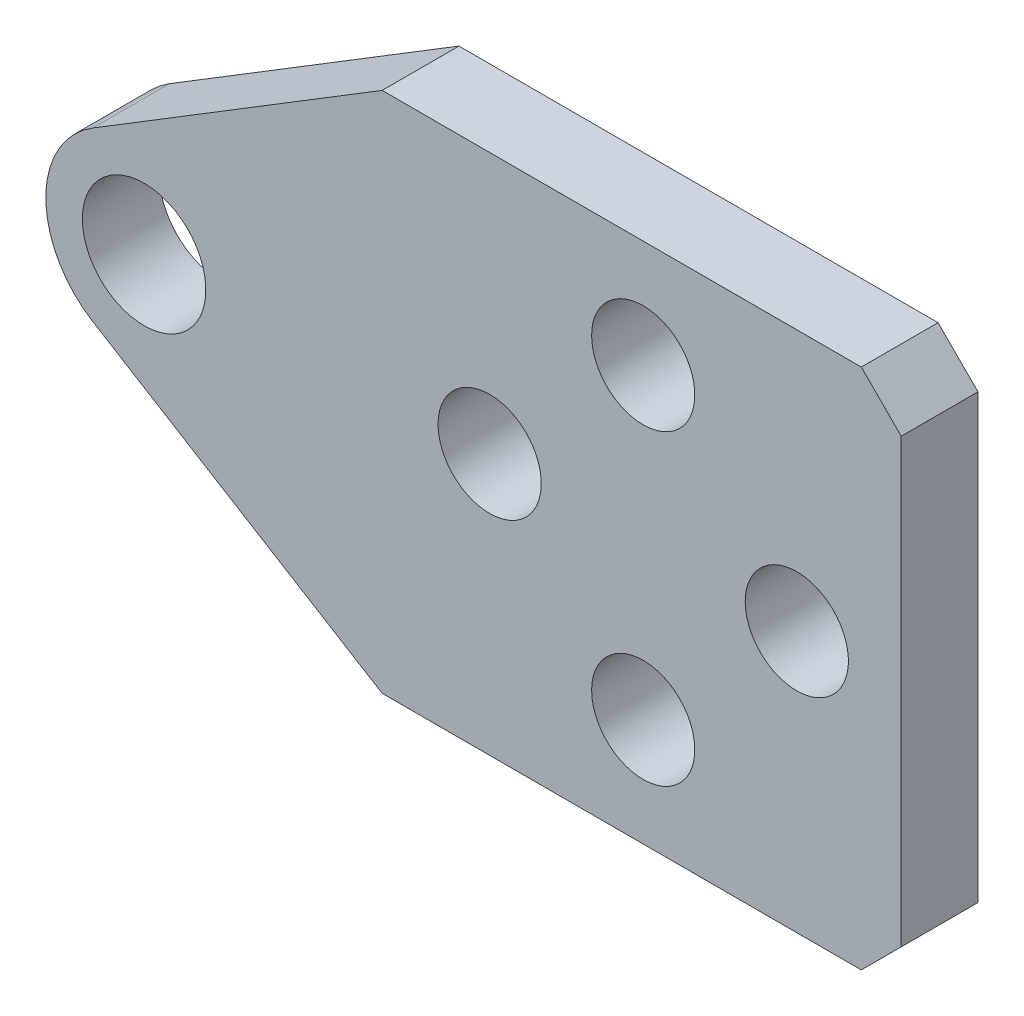
ISO-10303-21;
HEADER;
FILE_DESCRIPTION(('STEP AP214'),'2;1');
FILE_NAME('part.step','',(''),(''),'','','');
FILE_SCHEMA(('AUTOMOTIVE_DESIGN { 1 0 10303 214 1 1 1 1 }'));
ENDSEC;
DATA;
#1=APPLICATION_CONTEXT('core data for automotive mechanical design processes');
#2=APPLICATION_PROTOCOL_DEFINITION('international standard','automotive_design',2000,#1);
#3=PRODUCT_CONTEXT('',#1,'mechanical');
#4=PRODUCT('Part','Part','',(#3));
#5=PRODUCT_RELATED_PRODUCT_CATEGORY('part','',(#4));
#6=PRODUCT_DEFINITION_FORMATION('','',#4);
#7=PRODUCT_DEFINITION_CONTEXT('part definition',#1,'design');
#8=PRODUCT_DEFINITION('design','',#6,#7);
#9=PRODUCT_DEFINITION_SHAPE('','',#8);
#10=(LENGTH_UNIT() NAMED_UNIT(*) SI_UNIT(.MILLI.,.METRE.));
#11=(NAMED_UNIT(*) PLANE_ANGLE_UNIT() SI_UNIT($,.RADIAN.));
#12=(NAMED_UNIT(*) SI_UNIT($,.STERADIAN.) SOLID_ANGLE_UNIT());
#13=UNCERTAINTY_MEASURE_WITH_UNIT(LENGTH_MEASURE(1.E-05),#10,'distance_accuracy_value','');
#14=(GEOMETRIC_REPRESENTATION_CONTEXT(3) GLOBAL_UNCERTAINTY_ASSIGNED_CONTEXT((#13)) GLOBAL_UNIT_ASSIGNED_CONTEXT((#10,
#11,#12)) REPRESENTATION_CONTEXT('',''));
#15=CARTESIAN_POINT('',(0.,0.,0.));
#16=DIRECTION('',(0.,0.,1.));
#17=DIRECTION('',(1.,0.,0.));
#18=AXIS2_PLACEMENT_3D('',#15,#16,#17);
#19=CARTESIAN_POINT('',(-20.6375,0.,0.));
#20=DIRECTION('',(0.,0.,1.));
#21=DIRECTION('',(1.,0.,0.));
#22=AXIS2_PLACEMENT_3D('',#19,#20,#21);
#23=PLANE('',#22);
#24=CARTESIAN_POINT('',(-20.6375,0.,0.));
#25=DIRECTION('',(0.,0.,-1.));
#26=DIRECTION('',(-1.,0.,0.));
#27=AXIS2_PLACEMENT_3D('',#24,#25,#26);
#28=CIRCLE('',#27,2.5527);
#29=CARTESIAN_POINT('',(-23.1902,0.,0.));
#30=VERTEX_POINT('',#29);
#31=EDGE_CURVE('E160',#30,#30,#28,.F.);
#32=ORIENTED_EDGE('',*,*,#31,.T.);
#33=EDGE_LOOP('',(#32));
#34=FACE_BOUND('',#33,.T.);
#35=CARTESIAN_POINT('',(-6.35,0.,0.));
#36=DIRECTION('',(0.,0.,-1.));
#37=DIRECTION('',(-1.,0.,0.));
#38=AXIS2_PLACEMENT_3D('',#35,#36,#37);
#39=CIRCLE('',#38,2.1336);
#40=CARTESIAN_POINT('',(-8.4836,0.,0.));
#41=VERTEX_POINT('',#40);
#42=EDGE_CURVE('E20',#41,#41,#39,.F.);
#43=ORIENTED_EDGE('',*,*,#42,.T.);
#44=EDGE_LOOP('',(#43));
#45=FACE_BOUND('',#44,.T.);
#46=CARTESIAN_POINT('',(0.,-6.35,0.));
#47=DIRECTION('',(0.,0.,-1.));
#48=DIRECTION('',(-1.,0.,0.));
#49=AXIS2_PLACEMENT_3D('',#46,#47,#48);
#50=CIRCLE('',#49,2.1336);
#51=CARTESIAN_POINT('',(-2.1336,-6.35,0.));
#52=VERTEX_POINT('',#51);
#53=EDGE_CURVE('E163',#52,#52,#50,.F.);
#54=ORIENTED_EDGE('',*,*,#53,.T.);
#55=EDGE_LOOP('',(#54));
#56=FACE_BOUND('',#55,.T.);
#57=CARTESIAN_POINT('',(0.,6.35,0.));
#58=DIRECTION('',(0.,0.,-1.));
#59=DIRECTION('',(-1.,0.,0.));
#60=AXIS2_PLACEMENT_3D('',#57,#58,#59);
#61=CIRCLE('',#60,2.1336);
#62=CARTESIAN_POINT('',(-2.1336,6.35,0.));
#63=VERTEX_POINT('',#62);
#64=EDGE_CURVE('E104',#63,#63,#61,.F.);
#65=ORIENTED_EDGE('',*,*,#64,.T.);
#66=EDGE_LOOP('',(#65));
#67=FACE_BOUND('',#66,.T.);
#68=CARTESIAN_POINT('',(6.35,0.,0.));
#69=DIRECTION('',(0.,0.,-1.));
#70=DIRECTION('',(-1.,0.,0.));
#71=AXIS2_PLACEMENT_3D('',#68,#69,#70);
#72=CIRCLE('',#71,2.1336);
#73=CARTESIAN_POINT('',(4.2164,0.,0.));
#74=VERTEX_POINT('',#73);
#75=EDGE_CURVE('E121',#74,#74,#72,.F.);
#76=ORIENTED_EDGE('',*,*,#75,.T.);
#77=EDGE_LOOP('',(#76));
#78=FACE_BOUND('',#77,.T.);
#79=DIRECTION('',(-0.707106781186548,-0.707106781186547,0.));
#80=VECTOR('',#79,1.);
#81=CARTESIAN_POINT('',(10.668,-9.144,0.));
#82=LINE('',#81,#80);
#83=CARTESIAN_POINT('',(10.668,-9.144,0.));
#84=VERTEX_POINT('',#83);
#85=CARTESIAN_POINT('',(9.017,-10.795,0.));
#86=VERTEX_POINT('',#85);
#87=EDGE_CURVE('E88',#84,#86,#82,.T.);
#88=ORIENTED_EDGE('',*,*,#87,.T.);
#89=DIRECTION('',(1.,0.,0.));
#90=VECTOR('',#89,1.);
#91=CARTESIAN_POINT('',(10.668,-10.795,0.));
#92=LINE('',#91,#90);
#93=CARTESIAN_POINT('',(-10.795,-10.795,0.));
#94=VERTEX_POINT('',#93);
#95=EDGE_CURVE('E90',#86,#94,#92,.F.);
#96=ORIENTED_EDGE('',*,*,#95,.T.);
#97=DIRECTION('',(-0.852731064651707,0.522350199940582,0.));
#98=VECTOR('',#97,1.);
#99=CARTESIAN_POINT('',(-10.795,-10.795,0.));
#100=LINE('',#99,#98);
#101=CARTESIAN_POINT('',(-22.7603312125585,-3.46549904674454,0.));
#102=VERTEX_POINT('',#101);
#103=EDGE_CURVE('E119',#94,#102,#100,.T.);
#104=ORIENTED_EDGE('',*,*,#103,.T.);
#105=CARTESIAN_POINT('',(-20.6375,0.,0.));
#106=DIRECTION('',(0.,0.,-1.));
#107=DIRECTION('',(-1.,0.,0.));
#108=AXIS2_PLACEMENT_3D('',#105,#106,#107);
#109=CIRCLE('',#108,4.064);
#110=CARTESIAN_POINT('',(-22.7603312125585,3.46549904674454,0.));
#111=VERTEX_POINT('',#110);
#112=EDGE_CURVE('E49',#111,#102,#109,.F.);
#113=ORIENTED_EDGE('',*,*,#112,.F.);
#114=DIRECTION('',(0.852731064651707,0.522350199940582,0.));
#115=VECTOR('',#114,1.);
#116=CARTESIAN_POINT('',(-22.7603312125585,3.46549904674454,0.));
#117=LINE('',#116,#115);
#118=CARTESIAN_POINT('',(-10.795,10.795,0.));
#119=VERTEX_POINT('',#118);
#120=EDGE_CURVE('E126',#111,#119,#117,.T.);
#121=ORIENTED_EDGE('',*,*,#120,.T.);
#122=DIRECTION('',(1.,0.,0.));
#123=VECTOR('',#122,1.);
#124=CARTESIAN_POINT('',(-10.795,10.795,0.));
#125=LINE('',#124,#123);
#126=CARTESIAN_POINT('',(9.017,10.795,0.));
#127=VERTEX_POINT('',#126);
#128=EDGE_CURVE('E64',#119,#127,#125,.T.);
#129=ORIENTED_EDGE('',*,*,#128,.T.);
#130=DIRECTION('',(0.707106781186547,-0.707106781186548,0.));
#131=VECTOR('',#130,1.);
#132=CARTESIAN_POINT('',(9.017,10.795,0.));
#133=LINE('',#132,#131);
#134=CARTESIAN_POINT('',(10.668,9.144,0.));
#135=VERTEX_POINT('',#134);
#136=EDGE_CURVE('E137',#127,#135,#133,.T.);
#137=ORIENTED_EDGE('',*,*,#136,.T.);
#138=DIRECTION('',(0.,1.,0.));
#139=VECTOR('',#138,1.);
#140=CARTESIAN_POINT('',(10.668,10.795,0.));
#141=LINE('',#140,#139);
#142=EDGE_CURVE('E86',#135,#84,#141,.F.);
#143=ORIENTED_EDGE('',*,*,#142,.T.);
#144=EDGE_LOOP('',(#88,#96,#104,#113,#121,#129,#137,#143));
#145=FACE_BOUND('',#144,.T.);
#146=ADVANCED_FACE('F17',(#34,#45,#56,#67,#78,#145),#23,.F.);
#147=CARTESIAN_POINT('',(-6.35,0.,3.175));
#148=DIRECTION('',(0.,0.,-1.));
#149=DIRECTION('',(-1.,0.,0.));
#150=AXIS2_PLACEMENT_3D('',#147,#148,#149);
#151=CYLINDRICAL_SURFACE('',#150,2.1336);
#152=CARTESIAN_POINT('',(-6.35,0.,3.175));
#153=DIRECTION('',(0.,0.,-1.));
#154=DIRECTION('',(-1.,0.,0.));
#155=AXIS2_PLACEMENT_3D('',#152,#153,#154);
#156=CIRCLE('',#155,2.1336);
#157=CARTESIAN_POINT('',(-8.4836,0.,3.175));
#158=VERTEX_POINT('',#157);
#159=EDGE_CURVE('E157',#158,#158,#156,.T.);
#160=ORIENTED_EDGE('',*,*,#159,.F.);
#161=EDGE_LOOP('',(#160));
#162=FACE_BOUND('',#161,.T.);
#163=ORIENTED_EDGE('',*,*,#42,.F.);
#164=EDGE_LOOP('',(#163));
#165=FACE_BOUND('',#164,.T.);
#166=ADVANCED_FACE('F177',(#162,#165),#151,.F.);
#167=CARTESIAN_POINT('',(0.,6.35,3.175));
#168=DIRECTION('',(0.,0.,-1.));
#169=DIRECTION('',(-1.,0.,0.));
#170=AXIS2_PLACEMENT_3D('',#167,#168,#169);
#171=CYLINDRICAL_SURFACE('',#170,2.1336);
#172=CARTESIAN_POINT('',(0.,6.35,3.175));
#173=DIRECTION('',(0.,0.,-1.));
#174=DIRECTION('',(-1.,0.,0.));
#175=AXIS2_PLACEMENT_3D('',#172,#173,#174);
#176=CIRCLE('',#175,2.1336);
#177=CARTESIAN_POINT('',(-2.1336,6.35,3.175));
#178=VERTEX_POINT('',#177);
#179=EDGE_CURVE('E153',#178,#178,#176,.T.);
#180=ORIENTED_EDGE('',*,*,#179,.F.);
#181=EDGE_LOOP('',(#180));
#182=FACE_BOUND('',#181,.T.);
#183=ORIENTED_EDGE('',*,*,#64,.F.);
#184=EDGE_LOOP('',(#183));
#185=FACE_BOUND('',#184,.T.);
#186=ADVANCED_FACE('F179',(#182,#185),#171,.F.);
#187=CARTESIAN_POINT('',(10.668,-10.795,3.175));
#188=DIRECTION('',(0.,1.,0.));
#189=DIRECTION('',(0.,0.,1.));
#190=AXIS2_PLACEMENT_3D('',#187,#188,#189);
#191=PLANE('',#190);
#192=DIRECTION('',(0.,0.,1.));
#193=VECTOR('',#192,1.);
#194=CARTESIAN_POINT('',(9.017,-10.795,3.175));
#195=LINE('',#194,#193);
#196=CARTESIAN_POINT('',(9.017,-10.795,3.175));
#197=VERTEX_POINT('',#196);
#198=EDGE_CURVE('E95',#86,#197,#195,.T.);
#199=ORIENTED_EDGE('',*,*,#198,.T.);
#200=DIRECTION('',(1.,0.,0.));
#201=VECTOR('',#200,1.);
#202=CARTESIAN_POINT('',(-20.6375,-10.795,3.175));
#203=LINE('',#202,#201);
#204=CARTESIAN_POINT('',(-10.795,-10.795,3.175));
#205=VERTEX_POINT('',#204);
#206=EDGE_CURVE('E156',#205,#197,#203,.T.);
#207=ORIENTED_EDGE('',*,*,#206,.F.);
#208=DIRECTION('',(0.,0.,1.));
#209=VECTOR('',#208,1.);
#210=CARTESIAN_POINT('',(-10.795,-10.795,3.175));
#211=LINE('',#210,#209);
#212=EDGE_CURVE('E102',#205,#94,#211,.F.);
#213=ORIENTED_EDGE('',*,*,#212,.T.);
#214=ORIENTED_EDGE('',*,*,#95,.F.);
#215=EDGE_LOOP('',(#199,#207,#213,#214));
#216=FACE_BOUND('',#215,.T.);
#217=ADVANCED_FACE('F98',(#216),#191,.F.);
#218=CARTESIAN_POINT('',(10.668,-9.144,3.175));
#219=DIRECTION('',(-0.707106781186547,0.707106781186548,0.));
#220=DIRECTION('',(-0.707106781186548,-0.707106781186547,0.));
#221=AXIS2_PLACEMENT_3D('',#218,#219,#220);
#222=PLANE('',#221);
#223=ORIENTED_EDGE('',*,*,#198,.F.);
#224=ORIENTED_EDGE('',*,*,#87,.F.);
#225=DIRECTION('',(0.,0.,1.));
#226=VECTOR('',#225,1.);
#227=CARTESIAN_POINT('',(10.668,-9.144,3.175));
#228=LINE('',#227,#226);
#229=CARTESIAN_POINT('',(10.668,-9.144,3.175));
#230=VERTEX_POINT('',#229);
#231=EDGE_CURVE('E111',#84,#230,#228,.T.);
#232=ORIENTED_EDGE('',*,*,#231,.T.);
#233=DIRECTION('',(0.707106781186548,0.707106781186547,0.));
#234=VECTOR('',#233,1.);
#235=CARTESIAN_POINT('',(9.017,-10.795,3.175));
#236=LINE('',#235,#234);
#237=EDGE_CURVE('E108',#197,#230,#236,.T.);
#238=ORIENTED_EDGE('',*,*,#237,.F.);
#239=EDGE_LOOP('',(#223,#224,#232,#238));
#240=FACE_BOUND('',#239,.T.);
#241=ADVANCED_FACE('F106',(#240),#222,.F.);
#242=CARTESIAN_POINT('',(10.668,10.795,3.175));
#243=DIRECTION('',(-1.,0.,0.));
#244=DIRECTION('',(0.,0.,1.));
#245=AXIS2_PLACEMENT_3D('',#242,#243,#244);
#246=PLANE('',#245);
#247=ORIENTED_EDGE('',*,*,#231,.F.);
#248=ORIENTED_EDGE('',*,*,#142,.F.);
#249=DIRECTION('',(0.,0.,1.));
#250=VECTOR('',#249,1.);
#251=CARTESIAN_POINT('',(10.668,9.144,3.175));
#252=LINE('',#251,#250);
#253=CARTESIAN_POINT('',(10.668,9.144,3.175));
#254=VERTEX_POINT('',#253);
#255=EDGE_CURVE('E134',#135,#254,#252,.T.);
#256=ORIENTED_EDGE('',*,*,#255,.T.);
#257=DIRECTION('',(0.,1.,0.));
#258=VECTOR('',#257,1.);
#259=CARTESIAN_POINT('',(10.668,0.,3.175));
#260=LINE('',#259,#258);
#261=EDGE_CURVE('E331',#230,#254,#260,.T.);
#262=ORIENTED_EDGE('',*,*,#261,.F.);
#263=EDGE_LOOP('',(#247,#248,#256,#262));
#264=FACE_BOUND('',#263,.T.);
#265=ADVANCED_FACE('F227',(#264),#246,.F.);
#266=CARTESIAN_POINT('',(9.017,10.795,3.175));
#267=DIRECTION('',(-0.707106781186548,-0.707106781186547,0.));
#268=DIRECTION('',(0.707106781186547,-0.707106781186548,0.));
#269=AXIS2_PLACEMENT_3D('',#266,#267,#268);
#270=PLANE('',#269);
#271=ORIENTED_EDGE('',*,*,#255,.F.);
#272=ORIENTED_EDGE('',*,*,#136,.F.);
#273=DIRECTION('',(0.,0.,-1.));
#274=VECTOR('',#273,1.);
#275=CARTESIAN_POINT('',(9.017,10.795,3.175));
#276=LINE('',#275,#274);
#277=CARTESIAN_POINT('',(9.017,10.795,3.175));
#278=VERTEX_POINT('',#277);
#279=EDGE_CURVE('E133',#127,#278,#276,.F.);
#280=ORIENTED_EDGE('',*,*,#279,.T.);
#281=DIRECTION('',(-0.707106781186547,0.707106781186548,0.));
#282=VECTOR('',#281,1.);
#283=CARTESIAN_POINT('',(10.668,9.144,3.175));
#284=LINE('',#283,#282);
#285=EDGE_CURVE('E338',#254,#278,#284,.T.);
#286=ORIENTED_EDGE('',*,*,#285,.F.);
#287=EDGE_LOOP('',(#271,#272,#280,#286));
#288=FACE_BOUND('',#287,.T.);
#289=ADVANCED_FACE('F224',(#288),#270,.F.);
#290=CARTESIAN_POINT('',(-10.795,10.795,3.175));
#291=DIRECTION('',(0.,-1.,0.));
#292=DIRECTION('',(0.,0.,-1.));
#293=AXIS2_PLACEMENT_3D('',#290,#291,#292);
#294=PLANE('',#293);
#295=ORIENTED_EDGE('',*,*,#279,.F.);
#296=ORIENTED_EDGE('',*,*,#128,.F.);
#297=DIRECTION('',(0.,0.,1.));
#298=VECTOR('',#297,1.);
#299=CARTESIAN_POINT('',(-10.795,10.795,3.175));
#300=LINE('',#299,#298);
#301=CARTESIAN_POINT('',(-10.795,10.795,3.175));
#302=VERTEX_POINT('',#301);
#303=EDGE_CURVE('E129',#119,#302,#300,.T.);
#304=ORIENTED_EDGE('',*,*,#303,.T.);
#305=DIRECTION('',(1.,0.,0.));
#306=VECTOR('',#305,1.);
#307=CARTESIAN_POINT('',(-20.6375,10.795,3.175));
#308=LINE('',#307,#306);
#309=EDGE_CURVE('E350',#278,#302,#308,.F.);
#310=ORIENTED_EDGE('',*,*,#309,.F.);
#311=EDGE_LOOP('',(#295,#296,#304,#310));
#312=FACE_BOUND('',#311,.T.);
#313=ADVANCED_FACE('F220',(#312),#294,.F.);
#314=CARTESIAN_POINT('',(-22.7603312125585,3.46549904674454,3.175));
#315=DIRECTION('',(0.522350199940582,-0.852731064651707,0.));
#316=DIRECTION('',(0.852731064651707,0.522350199940582,0.));
#317=AXIS2_PLACEMENT_3D('',#314,#315,#316);
#318=PLANE('',#317);
#319=DIRECTION('',(0.,0.,-1.));
#320=VECTOR('',#319,1.);
#321=CARTESIAN_POINT('',(-22.7603312125585,3.46549904674454,3.175));
#322=LINE('',#321,#320);
#323=CARTESIAN_POINT('',(-22.7603312125585,3.46549904674454,3.175));
#324=VERTEX_POINT('',#323);
#325=EDGE_CURVE('E128',#324,#111,#322,.T.);
#326=ORIENTED_EDGE('',*,*,#325,.F.);
#327=DIRECTION('',(-0.852731064651707,-0.522350199940582,0.));
#328=VECTOR('',#327,1.);
#329=CARTESIAN_POINT('',(-10.795,10.795,3.175));
#330=LINE('',#329,#328);
#331=EDGE_CURVE('E152',#302,#324,#330,.T.);
#332=ORIENTED_EDGE('',*,*,#331,.F.);
#333=ORIENTED_EDGE('',*,*,#303,.F.);
#334=ORIENTED_EDGE('',*,*,#120,.F.);
#335=EDGE_LOOP('',(#326,#332,#333,#334));
#336=FACE_BOUND('',#335,.T.);
#337=ADVANCED_FACE('F217',(#336),#318,.F.);
#338=CARTESIAN_POINT('',(-20.6375,0.,3.175));
#339=DIRECTION('',(0.,0.,-1.));
#340=DIRECTION('',(-1.,0.,0.));
#341=AXIS2_PLACEMENT_3D('',#338,#339,#340);
#342=CYLINDRICAL_SURFACE('',#341,4.064);
#343=ORIENTED_EDGE('',*,*,#112,.T.);
#344=DIRECTION('',(0.,0.,1.));
#345=VECTOR('',#344,1.);
#346=CARTESIAN_POINT('',(-22.7603312125585,-3.46549904674454,3.175));
#347=LINE('',#346,#345);
#348=CARTESIAN_POINT('',(-22.7603312125585,-3.46549904674454,3.175));
#349=VERTEX_POINT('',#348);
#350=EDGE_CURVE('E168',#102,#349,#347,.T.);
#351=ORIENTED_EDGE('',*,*,#350,.T.);
#352=CARTESIAN_POINT('',(-20.6375,0.,3.175));
#353=DIRECTION('',(0.,0.,-1.));
#354=DIRECTION('',(-1.,0.,0.));
#355=AXIS2_PLACEMENT_3D('',#352,#353,#354);
#356=CIRCLE('',#355,4.064);
#357=EDGE_CURVE('E35',#324,#349,#356,.F.);
#358=ORIENTED_EDGE('',*,*,#357,.F.);
#359=ORIENTED_EDGE('',*,*,#325,.T.);
#360=EDGE_LOOP('',(#343,#351,#358,#359));
#361=FACE_BOUND('',#360,.T.);
#362=ADVANCED_FACE('F213',(#361),#342,.T.);
#363=CARTESIAN_POINT('',(-10.795,-10.795,3.175));
#364=DIRECTION('',(0.522350199940582,0.852731064651707,0.));
#365=DIRECTION('',(-0.852731064651707,0.522350199940582,0.));
#366=AXIS2_PLACEMENT_3D('',#363,#364,#365);
#367=PLANE('',#366);
#368=ORIENTED_EDGE('',*,*,#212,.F.);
#369=DIRECTION('',(0.852731064651707,-0.522350199940582,0.));
#370=VECTOR('',#369,1.);
#371=CARTESIAN_POINT('',(-22.7603312125585,-3.46549904674454,3.175));
#372=LINE('',#371,#370);
#373=EDGE_CURVE('E150',#349,#205,#372,.T.);
#374=ORIENTED_EDGE('',*,*,#373,.F.);
#375=ORIENTED_EDGE('',*,*,#350,.F.);
#376=ORIENTED_EDGE('',*,*,#103,.F.);
#377=EDGE_LOOP('',(#368,#374,#375,#376));
#378=FACE_BOUND('',#377,.T.);
#379=ADVANCED_FACE('F209',(#378),#367,.F.);
#380=CARTESIAN_POINT('',(6.35,0.,3.175));
#381=DIRECTION('',(0.,0.,-1.));
#382=DIRECTION('',(-1.,0.,0.));
#383=AXIS2_PLACEMENT_3D('',#380,#381,#382);
#384=CYLINDRICAL_SURFACE('',#383,2.1336);
#385=CARTESIAN_POINT('',(6.35,0.,3.175));
#386=DIRECTION('',(0.,0.,-1.));
#387=DIRECTION('',(-1.,0.,0.));
#388=AXIS2_PLACEMENT_3D('',#385,#386,#387);
#389=CIRCLE('',#388,2.1336);
#390=CARTESIAN_POINT('',(4.2164,0.,3.175));
#391=VERTEX_POINT('',#390);
#392=EDGE_CURVE('E147',#391,#391,#389,.T.);
#393=ORIENTED_EDGE('',*,*,#392,.F.);
#394=EDGE_LOOP('',(#393));
#395=FACE_BOUND('',#394,.T.);
#396=ORIENTED_EDGE('',*,*,#75,.F.);
#397=EDGE_LOOP('',(#396));
#398=FACE_BOUND('',#397,.T.);
#399=ADVANCED_FACE('F205',(#395,#398),#384,.F.);
#400=CARTESIAN_POINT('',(0.,-6.35,3.175));
#401=DIRECTION('',(0.,0.,-1.));
#402=DIRECTION('',(-1.,0.,0.));
#403=AXIS2_PLACEMENT_3D('',#400,#401,#402);
#404=CYLINDRICAL_SURFACE('',#403,2.1336);
#405=CARTESIAN_POINT('',(0.,-6.35,3.175));
#406=DIRECTION('',(0.,0.,-1.));
#407=DIRECTION('',(-1.,0.,0.));
#408=AXIS2_PLACEMENT_3D('',#405,#406,#407);
#409=CIRCLE('',#408,2.1336);
#410=CARTESIAN_POINT('',(-2.1336,-6.35,3.175));
#411=VERTEX_POINT('',#410);
#412=EDGE_CURVE('E26',#411,#411,#409,.T.);
#413=ORIENTED_EDGE('',*,*,#412,.F.);
#414=EDGE_LOOP('',(#413));
#415=FACE_BOUND('',#414,.T.);
#416=ORIENTED_EDGE('',*,*,#53,.F.);
#417=EDGE_LOOP('',(#416));
#418=FACE_BOUND('',#417,.T.);
#419=ADVANCED_FACE('F198',(#415,#418),#404,.F.);
#420=CARTESIAN_POINT('',(-20.6375,0.,3.175));
#421=DIRECTION('',(0.,0.,-1.));
#422=DIRECTION('',(-1.,0.,0.));
#423=AXIS2_PLACEMENT_3D('',#420,#421,#422);
#424=CYLINDRICAL_SURFACE('',#423,2.5527);
#425=CARTESIAN_POINT('',(-20.6375,0.,3.175));
#426=DIRECTION('',(0.,0.,-1.));
#427=DIRECTION('',(-1.,0.,0.));
#428=AXIS2_PLACEMENT_3D('',#425,#426,#427);
#429=CIRCLE('',#428,2.5527);
#430=CARTESIAN_POINT('',(-23.1902,0.,3.175));
#431=VERTEX_POINT('',#430);
#432=EDGE_CURVE('E11',#431,#431,#429,.T.);
#433=ORIENTED_EDGE('',*,*,#432,.F.);
#434=EDGE_LOOP('',(#433));
#435=FACE_BOUND('',#434,.T.);
#436=ORIENTED_EDGE('',*,*,#31,.F.);
#437=EDGE_LOOP('',(#436));
#438=FACE_BOUND('',#437,.T.);
#439=ADVANCED_FACE('F192',(#435,#438),#424,.F.);
#440=CARTESIAN_POINT('',(-20.6375,0.,3.175));
#441=DIRECTION('',(0.,0.,1.));
#442=DIRECTION('',(1.,0.,0.));
#443=AXIS2_PLACEMENT_3D('',#440,#441,#442);
#444=PLANE('',#443);
#445=ORIENTED_EDGE('',*,*,#432,.T.);
#446=EDGE_LOOP('',(#445));
#447=FACE_BOUND('',#446,.T.);
#448=ORIENTED_EDGE('',*,*,#412,.T.);
#449=EDGE_LOOP('',(#448));
#450=FACE_BOUND('',#449,.T.);
#451=ORIENTED_EDGE('',*,*,#392,.T.);
#452=EDGE_LOOP('',(#451));
#453=FACE_BOUND('',#452,.T.);
#454=ORIENTED_EDGE('',*,*,#357,.T.);
#455=ORIENTED_EDGE('',*,*,#373,.T.);
#456=ORIENTED_EDGE('',*,*,#206,.T.);
#457=ORIENTED_EDGE('',*,*,#237,.T.);
#458=ORIENTED_EDGE('',*,*,#261,.T.);
#459=ORIENTED_EDGE('',*,*,#285,.T.);
#460=ORIENTED_EDGE('',*,*,#309,.T.);
#461=ORIENTED_EDGE('',*,*,#331,.T.);
#462=EDGE_LOOP('',(#454,#455,#456,#457,#458,#459,#460,#461));
#463=FACE_BOUND('',#462,.T.);
#464=ORIENTED_EDGE('',*,*,#179,.T.);
#465=EDGE_LOOP('',(#464));
#466=FACE_BOUND('',#465,.T.);
#467=ORIENTED_EDGE('',*,*,#159,.T.);
#468=EDGE_LOOP('',(#467));
#469=FACE_BOUND('',#468,.T.);
#470=ADVANCED_FACE('F190',(#447,#450,#453,#463,#466,#469),#444,.T.);
#471=CLOSED_SHELL('',(#146,#166,#186,#217,#241,#265,#289,#313,#337,#362,#379,#399,#419,#439,#470));
#472=MANIFOLD_SOLID_BREP('B1',#471);
#473=ADVANCED_BREP_SHAPE_REPRESENTATION('',(#18,#472),#14);
#474=SHAPE_DEFINITION_REPRESENTATION(#9,#473);
ENDSEC;
END-ISO-10303-21;
